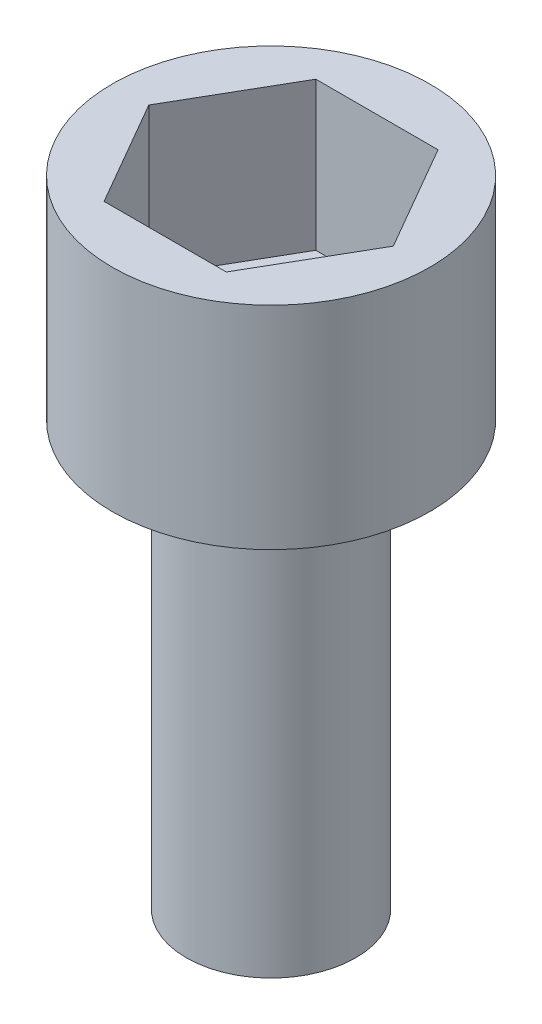
ISO-10303-21;
HEADER;
FILE_DESCRIPTION(('STEP AP214'),'2;1');
FILE_NAME('part.step','',(''),(''),'','','');
FILE_SCHEMA(('AUTOMOTIVE_DESIGN { 1 0 10303 214 1 1 1 1 }'));
ENDSEC;
DATA;
#1=APPLICATION_CONTEXT('core data for automotive mechanical design processes');
#2=APPLICATION_PROTOCOL_DEFINITION('international standard','automotive_design',2000,#1);
#3=PRODUCT_CONTEXT('',#1,'mechanical');
#4=PRODUCT('Part','Part','',(#3));
#5=PRODUCT_RELATED_PRODUCT_CATEGORY('part','',(#4));
#6=PRODUCT_DEFINITION_FORMATION('','',#4);
#7=PRODUCT_DEFINITION_CONTEXT('part definition',#1,'design');
#8=PRODUCT_DEFINITION('design','',#6,#7);
#9=PRODUCT_DEFINITION_SHAPE('','',#8);
#10=(LENGTH_UNIT() NAMED_UNIT(*) SI_UNIT(.MILLI.,.METRE.));
#11=(NAMED_UNIT(*) PLANE_ANGLE_UNIT() SI_UNIT($,.RADIAN.));
#12=(NAMED_UNIT(*) SI_UNIT($,.STERADIAN.) SOLID_ANGLE_UNIT());
#13=UNCERTAINTY_MEASURE_WITH_UNIT(LENGTH_MEASURE(1.E-05),#10,'distance_accuracy_value','');
#14=(GEOMETRIC_REPRESENTATION_CONTEXT(3) GLOBAL_UNCERTAINTY_ASSIGNED_CONTEXT((#13)) GLOBAL_UNIT_ASSIGNED_CONTEXT((#10,
#11,#12)) REPRESENTATION_CONTEXT('',''));
#15=CARTESIAN_POINT('',(0.,0.,0.));
#16=DIRECTION('',(0.,0.,1.));
#17=DIRECTION('',(1.,0.,0.));
#18=AXIS2_PLACEMENT_3D('',#15,#16,#17);
#19=CARTESIAN_POINT('',(0.,20.,0.));
#20=DIRECTION('',(0.,-1.,0.));
#21=DIRECTION('',(0.,0.,-1.));
#22=AXIS2_PLACEMENT_3D('',#19,#20,#21);
#23=CYLINDRICAL_SURFACE('',#22,4.);
#24=CARTESIAN_POINT('',(0.,20.,0.));
#25=DIRECTION('',(0.,1.,0.));
#26=DIRECTION('',(0.,0.,1.));
#27=AXIS2_PLACEMENT_3D('',#24,#25,#26);
#28=CIRCLE('',#27,4.);
#29=CARTESIAN_POINT('',(0.,20.,4.));
#30=VERTEX_POINT('',#29);
#31=EDGE_CURVE('E11',#30,#30,#28,.T.);
#32=ORIENTED_EDGE('',*,*,#31,.F.);
#33=EDGE_LOOP('',(#32));
#34=FACE_BOUND('',#33,.T.);
#35=CARTESIAN_POINT('',(0.,0.,0.));
#36=DIRECTION('',(0.,1.,0.));
#37=DIRECTION('',(0.,0.,1.));
#38=AXIS2_PLACEMENT_3D('',#35,#36,#37);
#39=CIRCLE('',#38,4.);
#40=CARTESIAN_POINT('',(0.,0.,4.));
#41=VERTEX_POINT('',#40);
#42=EDGE_CURVE('E46',#41,#41,#39,.T.);
#43=ORIENTED_EDGE('',*,*,#42,.T.);
#44=EDGE_LOOP('',(#43));
#45=FACE_BOUND('',#44,.T.);
#46=ADVANCED_FACE('F43',(#34,#45),#23,.T.);
#47=CARTESIAN_POINT('',(0.,0.,0.));
#48=DIRECTION('',(0.,1.,0.));
#49=DIRECTION('',(0.,0.,1.));
#50=AXIS2_PLACEMENT_3D('',#47,#48,#49);
#51=PLANE('',#50);
#52=ORIENTED_EDGE('',*,*,#42,.F.);
#53=EDGE_LOOP('',(#52));
#54=FACE_BOUND('',#53,.T.);
#55=ADVANCED_FACE('F178',(#54),#51,.F.);
#56=CARTESIAN_POINT('',(0.,23.,0.));
#57=DIRECTION('',(0.,-1.,0.));
#58=DIRECTION('',(0.,0.,-1.));
#59=AXIS2_PLACEMENT_3D('',#56,#57,#58);
#60=CYLINDRICAL_SURFACE('',#59,7.5);
#61=CARTESIAN_POINT('',(0.,20.,0.));
#62=DIRECTION('',(0.,1.,0.));
#63=DIRECTION('',(0.,0.,1.));
#64=AXIS2_PLACEMENT_3D('',#61,#62,#63);
#65=CIRCLE('',#64,7.5);
#66=CARTESIAN_POINT('',(0.,20.,7.5));
#67=VERTEX_POINT('',#66);
#68=EDGE_CURVE('E168',#67,#67,#65,.T.);
#69=ORIENTED_EDGE('',*,*,#68,.T.);
#70=EDGE_LOOP('',(#69));
#71=FACE_BOUND('',#70,.T.);
#72=CARTESIAN_POINT('',(0.,30.,0.));
#73=DIRECTION('',(0.,1.,0.));
#74=DIRECTION('',(0.,0.,1.));
#75=AXIS2_PLACEMENT_3D('',#72,#73,#74);
#76=CIRCLE('',#75,7.5);
#77=CARTESIAN_POINT('',(0.,30.,7.5));
#78=VERTEX_POINT('',#77);
#79=EDGE_CURVE('E112',#78,#78,#76,.T.);
#80=ORIENTED_EDGE('',*,*,#79,.F.);
#81=EDGE_LOOP('',(#80));
#82=FACE_BOUND('',#81,.T.);
#83=ADVANCED_FACE('F180',(#71,#82),#60,.T.);
#84=CARTESIAN_POINT('',(0.,20.,0.));
#85=DIRECTION('',(0.,1.,0.));
#86=DIRECTION('',(0.,0.,1.));
#87=AXIS2_PLACEMENT_3D('',#84,#85,#86);
#88=PLANE('',#87);
#89=ORIENTED_EDGE('',*,*,#31,.T.);
#90=EDGE_LOOP('',(#89));
#91=FACE_BOUND('',#90,.T.);
#92=ORIENTED_EDGE('',*,*,#68,.F.);
#93=EDGE_LOOP('',(#92));
#94=FACE_BOUND('',#93,.T.);
#95=ADVANCED_FACE('F185',(#91,#94),#88,.F.);
#96=CARTESIAN_POINT('',(0.,30.,0.));
#97=DIRECTION('',(0.,1.,0.));
#98=DIRECTION('',(0.,0.,1.));
#99=AXIS2_PLACEMENT_3D('',#96,#97,#98);
#100=PLANE('',#99);
#101=ORIENTED_EDGE('',*,*,#79,.T.);
#102=EDGE_LOOP('',(#101));
#103=FACE_BOUND('',#102,.T.);
#104=DIRECTION('',(-0.5,0.,-0.866025403784438));
#105=VECTOR('',#104,1.);
#106=CARTESIAN_POINT('',(5.77350269189626,30.,0.));
#107=LINE('',#106,#105);
#108=CARTESIAN_POINT('',(5.77350269189626,30.,0.));
#109=VERTEX_POINT('',#108);
#110=CARTESIAN_POINT('',(2.88675134594813,30.,-5.));
#111=VERTEX_POINT('',#110);
#112=EDGE_CURVE('E105',#109,#111,#107,.T.);
#113=ORIENTED_EDGE('',*,*,#112,.F.);
#114=DIRECTION('',(0.5,0.,-0.866025403784439));
#115=VECTOR('',#114,1.);
#116=CARTESIAN_POINT('',(2.88675134594813,30.,5.));
#117=LINE('',#116,#115);
#118=CARTESIAN_POINT('',(2.88675134594813,30.,5.));
#119=VERTEX_POINT('',#118);
#120=EDGE_CURVE('E95',#119,#109,#117,.T.);
#121=ORIENTED_EDGE('',*,*,#120,.F.);
#122=DIRECTION('',(1.,0.,0.));
#123=VECTOR('',#122,1.);
#124=CARTESIAN_POINT('',(-2.88675134594813,30.,5.));
#125=LINE('',#124,#123);
#126=CARTESIAN_POINT('',(-2.88675134594813,30.,5.));
#127=VERTEX_POINT('',#126);
#128=EDGE_CURVE('E131',#127,#119,#125,.T.);
#129=ORIENTED_EDGE('',*,*,#128,.F.);
#130=DIRECTION('',(0.5,0.,0.866025403784438));
#131=VECTOR('',#130,1.);
#132=CARTESIAN_POINT('',(-5.77350269189626,30.,0.));
#133=LINE('',#132,#131);
#134=CARTESIAN_POINT('',(-5.77350269189626,30.,0.));
#135=VERTEX_POINT('',#134);
#136=EDGE_CURVE('E127',#135,#127,#133,.T.);
#137=ORIENTED_EDGE('',*,*,#136,.F.);
#138=DIRECTION('',(-0.5,0.,0.866025403784439));
#139=VECTOR('',#138,1.);
#140=CARTESIAN_POINT('',(-2.88675134594813,30.,-5.));
#141=LINE('',#140,#139);
#142=CARTESIAN_POINT('',(-2.88675134594813,30.,-5.));
#143=VERTEX_POINT('',#142);
#144=EDGE_CURVE('E122',#143,#135,#141,.T.);
#145=ORIENTED_EDGE('',*,*,#144,.F.);
#146=DIRECTION('',(-1.,0.,0.));
#147=VECTOR('',#146,1.);
#148=CARTESIAN_POINT('',(2.88675134594813,30.,-5.));
#149=LINE('',#148,#147);
#150=EDGE_CURVE('E118',#111,#143,#149,.T.);
#151=ORIENTED_EDGE('',*,*,#150,.F.);
#152=EDGE_LOOP('',(#113,#121,#129,#137,#145,#151));
#153=FACE_BOUND('',#152,.T.);
#154=ADVANCED_FACE('F116',(#103,#153),#100,.T.);
#155=CARTESIAN_POINT('',(2.88675134594813,30.,5.));
#156=DIRECTION('',(-0.866025403784439,0.,-0.5));
#157=DIRECTION('',(-0.5,0.,0.866025403784439));
#158=AXIS2_PLACEMENT_3D('',#155,#156,#157);
#159=PLANE('',#158);
#160=DIRECTION('',(0.5,0.,-0.866025403784439));
#161=VECTOR('',#160,1.);
#162=CARTESIAN_POINT('',(2.88675134594813,23.,5.));
#163=LINE('',#162,#161);
#164=CARTESIAN_POINT('',(2.88675134594813,23.,5.));
#165=VERTEX_POINT('',#164);
#166=CARTESIAN_POINT('',(5.77350269189626,23.,0.));
#167=VERTEX_POINT('',#166);
#168=EDGE_CURVE('E58',#165,#167,#163,.T.);
#169=ORIENTED_EDGE('',*,*,#168,.F.);
#170=DIRECTION('',(0.,-1.,0.));
#171=VECTOR('',#170,1.);
#172=CARTESIAN_POINT('',(2.88675134594813,30.,5.));
#173=LINE('',#172,#171);
#174=EDGE_CURVE('E100',#119,#165,#173,.T.);
#175=ORIENTED_EDGE('',*,*,#174,.F.);
#176=ORIENTED_EDGE('',*,*,#120,.T.);
#177=DIRECTION('',(0.,-1.,0.));
#178=VECTOR('',#177,1.);
#179=CARTESIAN_POINT('',(5.77350269189626,30.,0.));
#180=LINE('',#179,#178);
#181=EDGE_CURVE('E98',#109,#167,#180,.T.);
#182=ORIENTED_EDGE('',*,*,#181,.T.);
#183=EDGE_LOOP('',(#169,#175,#176,#182));
#184=FACE_BOUND('',#183,.T.);
#185=ADVANCED_FACE('F97',(#184),#159,.T.);
#186=CARTESIAN_POINT('',(5.77350269189626,30.,0.));
#187=DIRECTION('',(-0.866025403784438,0.,0.5));
#188=DIRECTION('',(0.5,0.,0.866025403784438));
#189=AXIS2_PLACEMENT_3D('',#186,#187,#188);
#190=PLANE('',#189);
#191=DIRECTION('',(-0.5,0.,-0.866025403784438));
#192=VECTOR('',#191,1.);
#193=CARTESIAN_POINT('',(5.77350269189626,23.,0.));
#194=LINE('',#193,#192);
#195=CARTESIAN_POINT('',(2.88675134594813,23.,-5.));
#196=VERTEX_POINT('',#195);
#197=EDGE_CURVE('E62',#167,#196,#194,.T.);
#198=ORIENTED_EDGE('',*,*,#197,.F.);
#199=ORIENTED_EDGE('',*,*,#181,.F.);
#200=ORIENTED_EDGE('',*,*,#112,.T.);
#201=DIRECTION('',(0.,-1.,0.));
#202=VECTOR('',#201,1.);
#203=CARTESIAN_POINT('',(2.88675134594813,30.,-5.));
#204=LINE('',#203,#202);
#205=EDGE_CURVE('E113',#111,#196,#204,.T.);
#206=ORIENTED_EDGE('',*,*,#205,.T.);
#207=EDGE_LOOP('',(#198,#199,#200,#206));
#208=FACE_BOUND('',#207,.T.);
#209=ADVANCED_FACE('F109',(#208),#190,.T.);
#210=CARTESIAN_POINT('',(2.88675134594813,30.,-5.));
#211=DIRECTION('',(0.,0.,1.));
#212=DIRECTION('',(1.,0.,0.));
#213=AXIS2_PLACEMENT_3D('',#210,#211,#212);
#214=PLANE('',#213);
#215=DIRECTION('',(-1.,0.,0.));
#216=VECTOR('',#215,1.);
#217=CARTESIAN_POINT('',(2.88675134594813,23.,-5.));
#218=LINE('',#217,#216);
#219=CARTESIAN_POINT('',(-2.88675134594813,23.,-5.));
#220=VERTEX_POINT('',#219);
#221=EDGE_CURVE('E138',#196,#220,#218,.T.);
#222=ORIENTED_EDGE('',*,*,#221,.F.);
#223=ORIENTED_EDGE('',*,*,#205,.F.);
#224=ORIENTED_EDGE('',*,*,#150,.T.);
#225=DIRECTION('',(0.,-1.,0.));
#226=VECTOR('',#225,1.);
#227=CARTESIAN_POINT('',(-2.88675134594813,30.,-5.));
#228=LINE('',#227,#226);
#229=EDGE_CURVE('E159',#143,#220,#228,.T.);
#230=ORIENTED_EDGE('',*,*,#229,.T.);
#231=EDGE_LOOP('',(#222,#223,#224,#230));
#232=FACE_BOUND('',#231,.T.);
#233=ADVANCED_FACE('F203',(#232),#214,.T.);
#234=CARTESIAN_POINT('',(-2.88675134594813,30.,-5.));
#235=DIRECTION('',(0.866025403784439,0.,0.5));
#236=DIRECTION('',(0.5,0.,-0.866025403784439));
#237=AXIS2_PLACEMENT_3D('',#234,#235,#236);
#238=PLANE('',#237);
#239=DIRECTION('',(-0.5,0.,0.866025403784439));
#240=VECTOR('',#239,1.);
#241=CARTESIAN_POINT('',(-2.88675134594813,23.,-5.));
#242=LINE('',#241,#240);
#243=CARTESIAN_POINT('',(-5.77350269189626,23.,0.));
#244=VERTEX_POINT('',#243);
#245=EDGE_CURVE('E141',#220,#244,#242,.T.);
#246=ORIENTED_EDGE('',*,*,#245,.F.);
#247=ORIENTED_EDGE('',*,*,#229,.F.);
#248=ORIENTED_EDGE('',*,*,#144,.T.);
#249=DIRECTION('',(0.,-1.,0.));
#250=VECTOR('',#249,1.);
#251=CARTESIAN_POINT('',(-5.77350269189626,30.,0.));
#252=LINE('',#251,#250);
#253=EDGE_CURVE('E155',#135,#244,#252,.T.);
#254=ORIENTED_EDGE('',*,*,#253,.T.);
#255=EDGE_LOOP('',(#246,#247,#248,#254));
#256=FACE_BOUND('',#255,.T.);
#257=ADVANCED_FACE('F206',(#256),#238,.T.);
#258=CARTESIAN_POINT('',(-5.77350269189626,30.,0.));
#259=DIRECTION('',(0.866025403784438,0.,-0.5));
#260=DIRECTION('',(-0.5,0.,-0.866025403784438));
#261=AXIS2_PLACEMENT_3D('',#258,#259,#260);
#262=PLANE('',#261);
#263=DIRECTION('',(0.5,0.,0.866025403784438));
#264=VECTOR('',#263,1.);
#265=CARTESIAN_POINT('',(-5.77350269189626,23.,0.));
#266=LINE('',#265,#264);
#267=CARTESIAN_POINT('',(-2.88675134594813,23.,5.));
#268=VERTEX_POINT('',#267);
#269=EDGE_CURVE('E144',#244,#268,#266,.T.);
#270=ORIENTED_EDGE('',*,*,#269,.F.);
#271=ORIENTED_EDGE('',*,*,#253,.F.);
#272=ORIENTED_EDGE('',*,*,#136,.T.);
#273=DIRECTION('',(0.,-1.,0.));
#274=VECTOR('',#273,1.);
#275=CARTESIAN_POINT('',(-2.88675134594813,30.,5.));
#276=LINE('',#275,#274);
#277=EDGE_CURVE('E151',#127,#268,#276,.T.);
#278=ORIENTED_EDGE('',*,*,#277,.T.);
#279=EDGE_LOOP('',(#270,#271,#272,#278));
#280=FACE_BOUND('',#279,.T.);
#281=ADVANCED_FACE('F210',(#280),#262,.T.);
#282=CARTESIAN_POINT('',(-2.88675134594813,30.,5.));
#283=DIRECTION('',(0.,0.,-1.));
#284=DIRECTION('',(-1.,0.,0.));
#285=AXIS2_PLACEMENT_3D('',#282,#283,#284);
#286=PLANE('',#285);
#287=DIRECTION('',(1.,0.,0.));
#288=VECTOR('',#287,1.);
#289=CARTESIAN_POINT('',(-2.88675134594813,23.,5.));
#290=LINE('',#289,#288);
#291=EDGE_CURVE('E106',#268,#165,#290,.T.);
#292=ORIENTED_EDGE('',*,*,#291,.F.);
#293=ORIENTED_EDGE('',*,*,#277,.F.);
#294=ORIENTED_EDGE('',*,*,#128,.T.);
#295=ORIENTED_EDGE('',*,*,#174,.T.);
#296=EDGE_LOOP('',(#292,#293,#294,#295));
#297=FACE_BOUND('',#296,.T.);
#298=ADVANCED_FACE('F195',(#297),#286,.T.);
#299=CARTESIAN_POINT('',(0.,23.,0.));
#300=DIRECTION('',(0.,1.,0.));
#301=DIRECTION('',(0.,0.,1.));
#302=AXIS2_PLACEMENT_3D('',#299,#300,#301);
#303=PLANE('',#302);
#304=ORIENTED_EDGE('',*,*,#168,.T.);
#305=ORIENTED_EDGE('',*,*,#197,.T.);
#306=ORIENTED_EDGE('',*,*,#221,.T.);
#307=ORIENTED_EDGE('',*,*,#245,.T.);
#308=ORIENTED_EDGE('',*,*,#269,.T.);
#309=ORIENTED_EDGE('',*,*,#291,.T.);
#310=EDGE_LOOP('',(#304,#305,#306,#307,#308,#309));
#311=FACE_BOUND('',#310,.T.);
#312=ADVANCED_FACE('F192',(#311),#303,.T.);
#313=CLOSED_SHELL('',(#46,#55,#83,#95,#154,#185,#209,#233,#257,#281,#298,#312));
#314=MANIFOLD_SOLID_BREP('B2',#313);
#315=ADVANCED_BREP_SHAPE_REPRESENTATION('',(#18,#314),#14);
#316=SHAPE_DEFINITION_REPRESENTATION(#9,#315);
ENDSEC;
END-ISO-10303-21;
